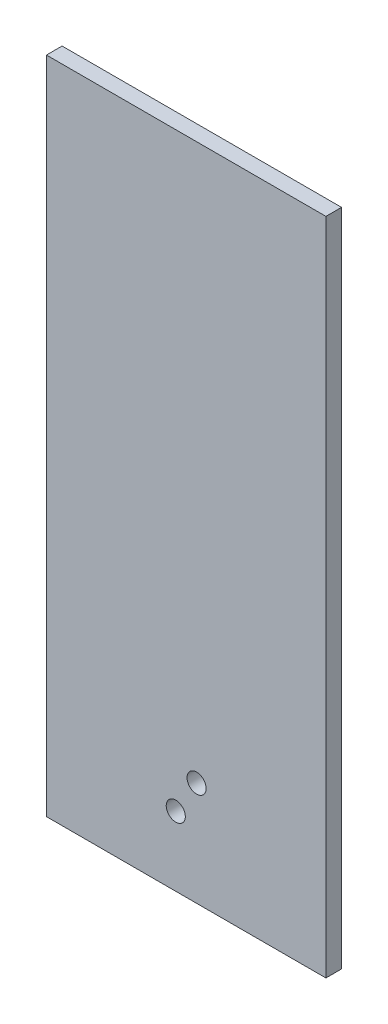
ISO-10303-21;
HEADER;
FILE_DESCRIPTION(('STEP AP214'),'2;1');
FILE_NAME('part.step','',(''),(''),'','','');
FILE_SCHEMA(('AUTOMOTIVE_DESIGN { 1 0 10303 214 1 1 1 1 }'));
ENDSEC;
DATA;
#1=APPLICATION_CONTEXT('core data for automotive mechanical design processes');
#2=APPLICATION_PROTOCOL_DEFINITION('international standard','automotive_design',2000,#1);
#3=PRODUCT_CONTEXT('',#1,'mechanical');
#4=PRODUCT('Part','Part','',(#3));
#5=PRODUCT_RELATED_PRODUCT_CATEGORY('part','',(#4));
#6=PRODUCT_DEFINITION_FORMATION('','',#4);
#7=PRODUCT_DEFINITION_CONTEXT('part definition',#1,'design');
#8=PRODUCT_DEFINITION('design','',#6,#7);
#9=PRODUCT_DEFINITION_SHAPE('','',#8);
#10=(LENGTH_UNIT() NAMED_UNIT(*) SI_UNIT(.MILLI.,.METRE.));
#11=(NAMED_UNIT(*) PLANE_ANGLE_UNIT() SI_UNIT($,.RADIAN.));
#12=(NAMED_UNIT(*) SI_UNIT($,.STERADIAN.) SOLID_ANGLE_UNIT());
#13=UNCERTAINTY_MEASURE_WITH_UNIT(LENGTH_MEASURE(1.E-05),#10,'distance_accuracy_value','');
#14=(GEOMETRIC_REPRESENTATION_CONTEXT(3) GLOBAL_UNCERTAINTY_ASSIGNED_CONTEXT((#13)) GLOBAL_UNIT_ASSIGNED_CONTEXT((#10,
#11,#12)) REPRESENTATION_CONTEXT('',''));
#15=CARTESIAN_POINT('',(0.,0.,0.));
#16=DIRECTION('',(0.,0.,1.));
#17=DIRECTION('',(1.,0.,0.));
#18=AXIS2_PLACEMENT_3D('',#15,#16,#17);
#19=CARTESIAN_POINT('',(80.5,-190.,9.));
#20=DIRECTION('',(-1.,0.,0.));
#21=DIRECTION('',(0.,0.,1.));
#22=AXIS2_PLACEMENT_3D('',#19,#20,#21);
#23=PLANE('',#22);
#24=DIRECTION('',(0.,1.,0.));
#25=VECTOR('',#24,1.);
#26=CARTESIAN_POINT('',(80.5,-190.,0.));
#27=LINE('',#26,#25);
#28=CARTESIAN_POINT('',(80.5,-190.,0.));
#29=VERTEX_POINT('',#28);
#30=CARTESIAN_POINT('',(80.5,190.,0.));
#31=VERTEX_POINT('',#30);
#32=EDGE_CURVE('E100',#29,#31,#27,.T.);
#33=ORIENTED_EDGE('',*,*,#32,.T.);
#34=DIRECTION('',(0.,0.,-1.));
#35=VECTOR('',#34,1.);
#36=CARTESIAN_POINT('',(80.5,190.,9.));
#37=LINE('',#36,#35);
#38=CARTESIAN_POINT('',(80.5,190.,9.));
#39=VERTEX_POINT('',#38);
#40=EDGE_CURVE('E11',#39,#31,#37,.T.);
#41=ORIENTED_EDGE('',*,*,#40,.F.);
#42=DIRECTION('',(0.,1.,0.));
#43=VECTOR('',#42,1.);
#44=CARTESIAN_POINT('',(80.5,-190.,9.));
#45=LINE('',#44,#43);
#46=CARTESIAN_POINT('',(80.5,-190.,9.));
#47=VERTEX_POINT('',#46);
#48=EDGE_CURVE('E88',#47,#39,#45,.T.);
#49=ORIENTED_EDGE('',*,*,#48,.F.);
#50=DIRECTION('',(0.,0.,-1.));
#51=VECTOR('',#50,1.);
#52=CARTESIAN_POINT('',(80.5,-190.,9.));
#53=LINE('',#52,#51);
#54=EDGE_CURVE('E96',#47,#29,#53,.T.);
#55=ORIENTED_EDGE('',*,*,#54,.T.);
#56=EDGE_LOOP('',(#33,#41,#49,#55));
#57=FACE_BOUND('',#56,.T.);
#58=ADVANCED_FACE('F37',(#57),#23,.F.);
#59=CARTESIAN_POINT('',(-80.5,190.,9.));
#60=DIRECTION('',(0.,-1.,0.));
#61=DIRECTION('',(0.,0.,-1.));
#62=AXIS2_PLACEMENT_3D('',#59,#60,#61);
#63=PLANE('',#62);
#64=DIRECTION('',(-1.,0.,0.));
#65=VECTOR('',#64,1.);
#66=CARTESIAN_POINT('',(-80.5,190.,0.));
#67=LINE('',#66,#65);
#68=CARTESIAN_POINT('',(-80.5,190.,0.));
#69=VERTEX_POINT('',#68);
#70=EDGE_CURVE('E92',#31,#69,#67,.T.);
#71=ORIENTED_EDGE('',*,*,#70,.T.);
#72=DIRECTION('',(0.,0.,-1.));
#73=VECTOR('',#72,1.);
#74=CARTESIAN_POINT('',(-80.5,190.,9.));
#75=LINE('',#74,#73);
#76=CARTESIAN_POINT('',(-80.5,190.,9.));
#77=VERTEX_POINT('',#76);
#78=EDGE_CURVE('E45',#77,#69,#75,.T.);
#79=ORIENTED_EDGE('',*,*,#78,.F.);
#80=DIRECTION('',(-1.,0.,0.));
#81=VECTOR('',#80,1.);
#82=CARTESIAN_POINT('',(-80.5,190.,9.));
#83=LINE('',#82,#81);
#84=EDGE_CURVE('E83',#39,#77,#83,.T.);
#85=ORIENTED_EDGE('',*,*,#84,.F.);
#86=ORIENTED_EDGE('',*,*,#40,.T.);
#87=EDGE_LOOP('',(#71,#79,#85,#86));
#88=FACE_BOUND('',#87,.T.);
#89=ADVANCED_FACE('F91',(#88),#63,.F.);
#90=CARTESIAN_POINT('',(-80.5,-190.,9.));
#91=DIRECTION('',(1.,0.,0.));
#92=DIRECTION('',(0.,0.,-1.));
#93=AXIS2_PLACEMENT_3D('',#90,#91,#92);
#94=PLANE('',#93);
#95=DIRECTION('',(0.,-1.,0.));
#96=VECTOR('',#95,1.);
#97=CARTESIAN_POINT('',(-80.5,-190.,0.));
#98=LINE('',#97,#96);
#99=CARTESIAN_POINT('',(-80.5,-190.,0.));
#100=VERTEX_POINT('',#99);
#101=EDGE_CURVE('E70',#69,#100,#98,.T.);
#102=ORIENTED_EDGE('',*,*,#101,.T.);
#103=DIRECTION('',(0.,0.,-1.));
#104=VECTOR('',#103,1.);
#105=CARTESIAN_POINT('',(-80.5,-190.,9.));
#106=LINE('',#105,#104);
#107=CARTESIAN_POINT('',(-80.5,-190.,9.));
#108=VERTEX_POINT('',#107);
#109=EDGE_CURVE('E93',#108,#100,#106,.T.);
#110=ORIENTED_EDGE('',*,*,#109,.F.);
#111=DIRECTION('',(0.,-1.,0.));
#112=VECTOR('',#111,1.);
#113=CARTESIAN_POINT('',(-80.5,-190.,9.));
#114=LINE('',#113,#112);
#115=EDGE_CURVE('E86',#77,#108,#114,.T.);
#116=ORIENTED_EDGE('',*,*,#115,.F.);
#117=ORIENTED_EDGE('',*,*,#78,.T.);
#118=EDGE_LOOP('',(#102,#110,#116,#117));
#119=FACE_BOUND('',#118,.T.);
#120=ADVANCED_FACE('F94',(#119),#94,.F.);
#121=CARTESIAN_POINT('',(-80.5,-190.,9.));
#122=DIRECTION('',(0.,1.,0.));
#123=DIRECTION('',(0.,0.,1.));
#124=AXIS2_PLACEMENT_3D('',#121,#122,#123);
#125=PLANE('',#124);
#126=DIRECTION('',(1.,0.,0.));
#127=VECTOR('',#126,1.);
#128=CARTESIAN_POINT('',(-80.5,-190.,0.));
#129=LINE('',#128,#127);
#130=EDGE_CURVE('E76',#100,#29,#129,.T.);
#131=ORIENTED_EDGE('',*,*,#130,.T.);
#132=ORIENTED_EDGE('',*,*,#54,.F.);
#133=DIRECTION('',(1.,0.,0.));
#134=VECTOR('',#133,1.);
#135=CARTESIAN_POINT('',(-80.5,-190.,9.));
#136=LINE('',#135,#134);
#137=EDGE_CURVE('E53',#108,#47,#136,.T.);
#138=ORIENTED_EDGE('',*,*,#137,.F.);
#139=ORIENTED_EDGE('',*,*,#109,.T.);
#140=EDGE_LOOP('',(#131,#132,#138,#139));
#141=FACE_BOUND('',#140,.T.);
#142=ADVANCED_FACE('F108',(#141),#125,.F.);
#143=CARTESIAN_POINT('',(0.,0.,9.));
#144=DIRECTION('',(0.,0.,-1.));
#145=DIRECTION('',(-1.,0.,0.));
#146=AXIS2_PLACEMENT_3D('',#143,#144,#145);
#147=PLANE('',#146);
#148=CARTESIAN_POINT('',(5.99999999999999,-130.,9.));
#149=DIRECTION('',(0.,0.,1.));
#150=DIRECTION('',(1.,0.,0.));
#151=AXIS2_PLACEMENT_3D('',#148,#149,#150);
#152=CIRCLE('',#151,5.50000000000001);
#153=CARTESIAN_POINT('',(11.5,-130.,9.));
#154=VERTEX_POINT('',#153);
#155=EDGE_CURVE('E120',#154,#154,#152,.T.);
#156=ORIENTED_EDGE('',*,*,#155,.F.);
#157=EDGE_LOOP('',(#156));
#158=FACE_BOUND('',#157,.T.);
#159=CARTESIAN_POINT('',(-6.,-150.,9.));
#160=DIRECTION('',(0.,0.,1.));
#161=DIRECTION('',(1.,0.,0.));
#162=AXIS2_PLACEMENT_3D('',#159,#160,#161);
#163=CIRCLE('',#162,5.5);
#164=CARTESIAN_POINT('',(-0.499999999999999,-150.,9.));
#165=VERTEX_POINT('',#164);
#166=EDGE_CURVE('E117',#165,#165,#163,.T.);
#167=ORIENTED_EDGE('',*,*,#166,.F.);
#168=EDGE_LOOP('',(#167));
#169=FACE_BOUND('',#168,.T.);
#170=ORIENTED_EDGE('',*,*,#48,.T.);
#171=ORIENTED_EDGE('',*,*,#84,.T.);
#172=ORIENTED_EDGE('',*,*,#115,.T.);
#173=ORIENTED_EDGE('',*,*,#137,.T.);
#174=EDGE_LOOP('',(#170,#171,#172,#173));
#175=FACE_BOUND('',#174,.T.);
#176=ADVANCED_FACE('F84',(#158,#169,#175),#147,.F.);
#177=CARTESIAN_POINT('',(0.,0.,0.));
#178=DIRECTION('',(0.,0.,-1.));
#179=DIRECTION('',(-1.,0.,0.));
#180=AXIS2_PLACEMENT_3D('',#177,#178,#179);
#181=PLANE('',#180);
#182=CARTESIAN_POINT('',(5.99999999999999,-130.,0.));
#183=DIRECTION('',(0.,0.,1.));
#184=DIRECTION('',(1.,0.,0.));
#185=AXIS2_PLACEMENT_3D('',#182,#183,#184);
#186=CIRCLE('',#185,5.50000000000001);
#187=CARTESIAN_POINT('',(11.5,-130.,0.));
#188=VERTEX_POINT('',#187);
#189=EDGE_CURVE('E103',#188,#188,#186,.T.);
#190=ORIENTED_EDGE('',*,*,#189,.T.);
#191=EDGE_LOOP('',(#190));
#192=FACE_BOUND('',#191,.T.);
#193=CARTESIAN_POINT('',(-6.,-150.,0.));
#194=DIRECTION('',(0.,0.,1.));
#195=DIRECTION('',(1.,0.,0.));
#196=AXIS2_PLACEMENT_3D('',#193,#194,#195);
#197=CIRCLE('',#196,5.5);
#198=CARTESIAN_POINT('',(-0.499999999999999,-150.,0.));
#199=VERTEX_POINT('',#198);
#200=EDGE_CURVE('E114',#199,#199,#197,.T.);
#201=ORIENTED_EDGE('',*,*,#200,.T.);
#202=EDGE_LOOP('',(#201));
#203=FACE_BOUND('',#202,.T.);
#204=ORIENTED_EDGE('',*,*,#32,.F.);
#205=ORIENTED_EDGE('',*,*,#130,.F.);
#206=ORIENTED_EDGE('',*,*,#101,.F.);
#207=ORIENTED_EDGE('',*,*,#70,.F.);
#208=EDGE_LOOP('',(#204,#205,#206,#207));
#209=FACE_BOUND('',#208,.T.);
#210=ADVANCED_FACE('F111',(#192,#203,#209),#181,.T.);
#211=CARTESIAN_POINT('',(-6.,-150.,0.));
#212=DIRECTION('',(0.,0.,1.));
#213=DIRECTION('',(1.,0.,0.));
#214=AXIS2_PLACEMENT_3D('',#211,#212,#213);
#215=CYLINDRICAL_SURFACE('',#214,5.5);
#216=ORIENTED_EDGE('',*,*,#200,.F.);
#217=EDGE_LOOP('',(#216));
#218=FACE_BOUND('',#217,.T.);
#219=ORIENTED_EDGE('',*,*,#166,.T.);
#220=EDGE_LOOP('',(#219));
#221=FACE_BOUND('',#220,.T.);
#222=ADVANCED_FACE('F131',(#218,#221),#215,.F.);
#223=CARTESIAN_POINT('',(5.99999999999999,-130.,0.));
#224=DIRECTION('',(0.,0.,1.));
#225=DIRECTION('',(1.,0.,0.));
#226=AXIS2_PLACEMENT_3D('',#223,#224,#225);
#227=CYLINDRICAL_SURFACE('',#226,5.50000000000001);
#228=ORIENTED_EDGE('',*,*,#189,.F.);
#229=EDGE_LOOP('',(#228));
#230=FACE_BOUND('',#229,.T.);
#231=ORIENTED_EDGE('',*,*,#155,.T.);
#232=EDGE_LOOP('',(#231));
#233=FACE_BOUND('',#232,.T.);
#234=ADVANCED_FACE('F128',(#230,#233),#227,.F.);
#235=CLOSED_SHELL('',(#58,#89,#120,#142,#176,#210,#222,#234));
#236=MANIFOLD_SOLID_BREP('B2',#235);
#237=ADVANCED_BREP_SHAPE_REPRESENTATION('',(#18,#236),#14);
#238=SHAPE_DEFINITION_REPRESENTATION(#9,#237);
ENDSEC;
END-ISO-10303-21;
